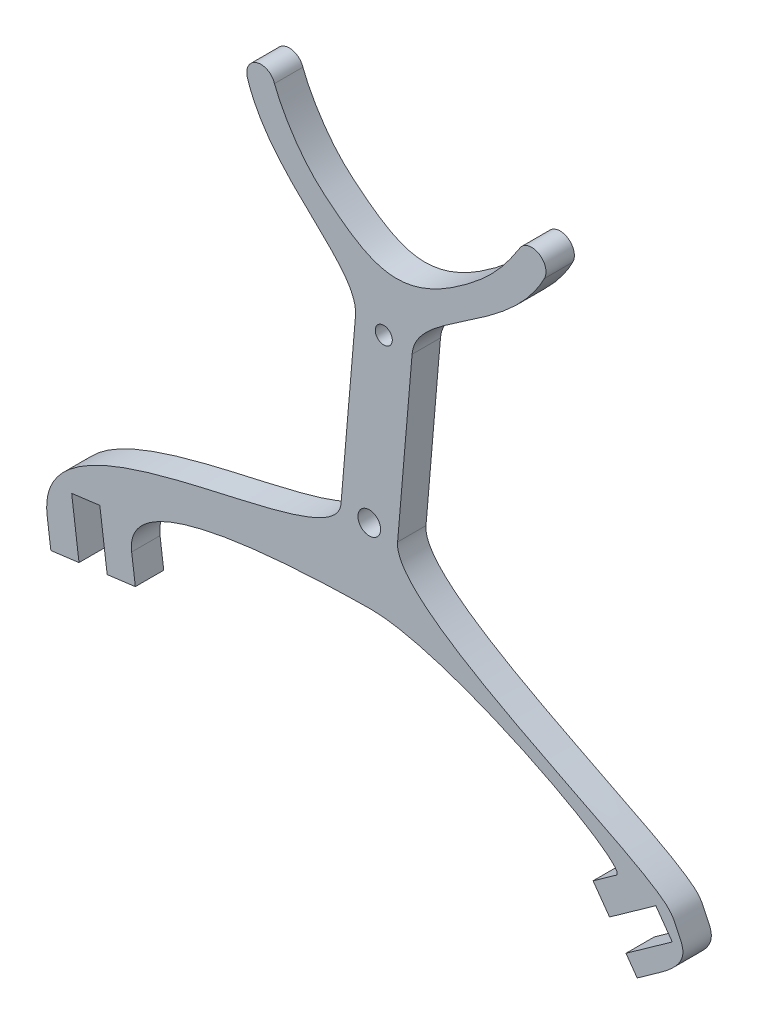
ISO-10303-21;
HEADER;
FILE_DESCRIPTION(('STEP AP214'),'2;1');
FILE_NAME('part.step','',(''),(''),'','','');
FILE_SCHEMA(('AUTOMOTIVE_DESIGN { 1 0 10303 214 1 1 1 1 }'));
ENDSEC;
DATA;
#1=APPLICATION_CONTEXT('core data for automotive mechanical design processes');
#2=APPLICATION_PROTOCOL_DEFINITION('international standard','automotive_design',2000,#1);
#3=PRODUCT_CONTEXT('',#1,'mechanical');
#4=PRODUCT('Part','Part','',(#3));
#5=PRODUCT_RELATED_PRODUCT_CATEGORY('part','',(#4));
#6=PRODUCT_DEFINITION_FORMATION('','',#4);
#7=PRODUCT_DEFINITION_CONTEXT('part definition',#1,'design');
#8=PRODUCT_DEFINITION('design','',#6,#7);
#9=PRODUCT_DEFINITION_SHAPE('','',#8);
#10=(LENGTH_UNIT() NAMED_UNIT(*) SI_UNIT(.MILLI.,.METRE.));
#11=(NAMED_UNIT(*) PLANE_ANGLE_UNIT() SI_UNIT($,.RADIAN.));
#12=(NAMED_UNIT(*) SI_UNIT($,.STERADIAN.) SOLID_ANGLE_UNIT());
#13=UNCERTAINTY_MEASURE_WITH_UNIT(LENGTH_MEASURE(1.E-05),#10,'distance_accuracy_value','');
#14=(GEOMETRIC_REPRESENTATION_CONTEXT(3) GLOBAL_UNCERTAINTY_ASSIGNED_CONTEXT((#13)) GLOBAL_UNIT_ASSIGNED_CONTEXT((#10,
#11,#12)) REPRESENTATION_CONTEXT('',''));
#15=CARTESIAN_POINT('',(0.,0.,0.));
#16=DIRECTION('',(0.,0.,1.));
#17=DIRECTION('',(1.,0.,0.));
#18=AXIS2_PLACEMENT_3D('',#15,#16,#17);
#19=CARTESIAN_POINT('',(-0.855147285631085,2.9330445335862,0.25));
#20=CARTESIAN_POINT('',(-0.802855117328799,2.79152286180849,0.25));
#21=CARTESIAN_POINT('',(-0.626812714664482,2.47827142112427,0.25));
#22=CARTESIAN_POINT('',(-0.0355605612279538,1.99176432732636,0.25));
#23=CARTESIAN_POINT('',(0.301694251700826,1.83750321109511,0.25));
#24=CARTESIAN_POINT('',(1.04416507128505,2.40599952490263,0.25));
#25=CARTESIAN_POINT('',(1.18935322128967,2.58003797829451,0.25));
#26=CARTESIAN_POINT('',(1.29860519890815,2.74932159459001,0.25));
#27=B_SPLINE_CURVE_WITH_KNOTS('',3,(#19,#20,#21,#22,#23,#24,#25,#26),.UNSPECIFIED.,.F.,.F.,(4,1,
1,1,1,4),(0.,0.244258262768071,0.330799972744395,0.806015196761144,0.878875389786914,1.),.UNSPECIFIED.);
#28=DIRECTION('',(0.,0.,-1.));
#29=VECTOR('',#28,1.);
#30=SURFACE_OF_LINEAR_EXTRUSION('',#27,#29);
#31=CARTESIAN_POINT('',(-0.855147285631085,2.9330445335862,0.));
#32=CARTESIAN_POINT('',(-0.802855117328799,2.79152286180849,0.));
#33=CARTESIAN_POINT('',(-0.626812714664482,2.47827142112427,0.));
#34=CARTESIAN_POINT('',(-0.0355605612279538,1.99176432732636,0.));
#35=CARTESIAN_POINT('',(0.301694251700826,1.83750321109511,0.));
#36=CARTESIAN_POINT('',(1.04416507128505,2.40599952490263,0.));
#37=CARTESIAN_POINT('',(1.18935322128967,2.58003797829451,0.));
#38=CARTESIAN_POINT('',(1.29860519890815,2.74932159459001,0.));
#39=B_SPLINE_CURVE_WITH_KNOTS('',3,(#31,#32,#33,#34,#35,#36,#37,#38),.UNSPECIFIED.,.F.,.F.,(4,1,
1,1,1,4),(0.,0.244258262768071,0.330799972744395,0.806015196761144,0.878875389786914,1.),.UNSPECIFIED.);
#40=CARTESIAN_POINT('',(-0.855147285631086,2.9330445335862,0.));
#41=VERTEX_POINT('',#40);
#42=CARTESIAN_POINT('',(1.29860519890815,2.74932159459,0.));
#43=VERTEX_POINT('',#42);
#44=EDGE_CURVE('E478',#41,#43,#39,.T.);
#45=ORIENTED_EDGE('',*,*,#44,.F.);
#46=DIRECTION('',(0.,0.,-1.));
#47=VECTOR('',#46,1.);
#48=CARTESIAN_POINT('',(-0.855147285631086,2.9330445335862,0.25));
#49=LINE('',#48,#47);
#50=CARTESIAN_POINT('',(-0.855147285631086,2.9330445335862,0.25));
#51=VERTEX_POINT('',#50);
#52=EDGE_CURVE('E11',#51,#41,#49,.T.);
#53=ORIENTED_EDGE('',*,*,#52,.F.);
#54=CARTESIAN_POINT('',(1.29860519890815,2.74932159459,0.25));
#55=VERTEX_POINT('',#54);
#56=EDGE_CURVE('E560',#51,#55,#27,.T.);
#57=ORIENTED_EDGE('',*,*,#56,.T.);
#58=DIRECTION('',(0.,0.,-1.));
#59=VECTOR('',#58,1.);
#60=CARTESIAN_POINT('',(1.29860519890815,2.74932159459,0.25));
#61=LINE('',#60,#59);
#62=EDGE_CURVE('E51',#55,#43,#61,.T.);
#63=ORIENTED_EDGE('',*,*,#62,.T.);
#64=EDGE_LOOP('',(#45,#53,#57,#63));
#65=FACE_BOUND('',#64,.T.);
#66=ADVANCED_FACE('F34',(#65),#30,.T.);
#67=CARTESIAN_POINT('',(-0.974284745858485,2.89521246292433,0.25));
#68=DIRECTION('',(0.,0.,-1.));
#69=DIRECTION('',(-1.,0.,0.));
#70=AXIS2_PLACEMENT_3D('',#67,#68,#69);
#71=CYLINDRICAL_SURFACE('',#70,0.125);
#72=CARTESIAN_POINT('',(-0.974284745858485,2.89521246292433,0.));
#73=DIRECTION('',(0.,0.,1.));
#74=DIRECTION('',(1.,0.,0.));
#75=AXIS2_PLACEMENT_3D('',#72,#73,#74);
#76=CIRCLE('',#75,0.125);
#77=CARTESIAN_POINT('',(-1.09342220608589,2.85738039226246,0.));
#78=VERTEX_POINT('',#77);
#79=EDGE_CURVE('E475',#41,#78,#76,.T.);
#80=ORIENTED_EDGE('',*,*,#79,.T.);
#81=DIRECTION('',(0.,0.,-1.));
#82=VECTOR('',#81,1.);
#83=CARTESIAN_POINT('',(-1.09342220608589,2.85738039226246,0.25));
#84=LINE('',#83,#82);
#85=CARTESIAN_POINT('',(-1.09342220608589,2.85738039226246,0.25));
#86=VERTEX_POINT('',#85);
#87=EDGE_CURVE('E43',#86,#78,#84,.T.);
#88=ORIENTED_EDGE('',*,*,#87,.F.);
#89=CARTESIAN_POINT('',(-0.974284745858485,2.89521246292433,0.25));
#90=DIRECTION('',(0.,0.,1.));
#91=DIRECTION('',(1.,0.,0.));
#92=AXIS2_PLACEMENT_3D('',#89,#90,#91);
#93=CIRCLE('',#92,0.125);
#94=EDGE_CURVE('E581',#51,#86,#93,.T.);
#95=ORIENTED_EDGE('',*,*,#94,.F.);
#96=ORIENTED_EDGE('',*,*,#52,.T.);
#97=EDGE_LOOP('',(#80,#88,#95,#96));
#98=FACE_BOUND('',#97,.T.);
#99=ADVANCED_FACE('F476',(#98),#71,.T.);
#100=CARTESIAN_POINT('',(-0.142105820633665,1.51736113385863,0.25));
#101=CARTESIAN_POINT('',(-0.109838871575818,1.89562104022381,0.25));
#102=CARTESIAN_POINT('',(-0.885940974960235,2.20399857919461,0.25));
#103=CARTESIAN_POINT('',(-1.09342220608588,2.85738039226246,0.25));
#104=B_SPLINE_CURVE_WITH_KNOTS('',3,(#100,#101,#102,#103),.UNSPECIFIED.,.F.,.F.,(4,4),(0.,1.),.UNSPECIFIED.);
#105=DIRECTION('',(0.,0.,-1.));
#106=VECTOR('',#105,1.);
#107=SURFACE_OF_LINEAR_EXTRUSION('',#104,#106);
#108=CARTESIAN_POINT('',(-0.142105820633665,1.51736113385863,0.));
#109=CARTESIAN_POINT('',(-0.109838871575818,1.89562104022381,0.));
#110=CARTESIAN_POINT('',(-0.885940974960235,2.20399857919461,0.));
#111=CARTESIAN_POINT('',(-1.09342220608588,2.85738039226246,0.));
#112=B_SPLINE_CURVE_WITH_KNOTS('',3,(#108,#109,#110,#111),.UNSPECIFIED.,.F.,.F.,(4,4),(0.,1.),.UNSPECIFIED.);
#113=CARTESIAN_POINT('',(-0.142105820633664,1.51736113385863,0.));
#114=VERTEX_POINT('',#113);
#115=EDGE_CURVE('E469',#114,#78,#112,.T.);
#116=ORIENTED_EDGE('',*,*,#115,.F.);
#117=DIRECTION('',(0.,0.,-1.));
#118=VECTOR('',#117,1.);
#119=CARTESIAN_POINT('',(-0.142105820633664,1.51736113385863,0.25));
#120=LINE('',#119,#118);
#121=CARTESIAN_POINT('',(-0.142105820633664,1.51736113385863,0.25));
#122=VERTEX_POINT('',#121);
#123=EDGE_CURVE('E461',#122,#114,#120,.T.);
#124=ORIENTED_EDGE('',*,*,#123,.F.);
#125=EDGE_CURVE('E472',#122,#86,#104,.T.);
#126=ORIENTED_EDGE('',*,*,#125,.T.);
#127=ORIENTED_EDGE('',*,*,#87,.T.);
#128=EDGE_LOOP('',(#116,#124,#126,#127));
#129=FACE_BOUND('',#128,.T.);
#130=ADVANCED_FACE('F467',(#129),#107,.T.);
#131=CARTESIAN_POINT('',(-0.761407991854135,-5.74261193882451,0.25));
#132=DIRECTION('',(-0.996381380815078,0.0849949643510695,0.));
#133=DIRECTION('',(-0.0849949643510695,-0.996381380815078,0.));
#134=AXIS2_PLACEMENT_3D('',#131,#132,#133);
#135=PLANE('',#134);
#136=DIRECTION('',(0.0849949643510695,0.996381380815078,0.));
#137=VECTOR('',#136,1.);
#138=CARTESIAN_POINT('',(-0.761407991854135,-5.74261193882451,0.));
#139=LINE('',#138,#137);
#140=CARTESIAN_POINT('',(-0.269598267160269,0.0227890626360175,0.));
#141=VERTEX_POINT('',#140);
#142=EDGE_CURVE('E484',#141,#114,#139,.T.);
#143=ORIENTED_EDGE('',*,*,#142,.F.);
#144=DIRECTION('',(0.,0.,-1.));
#145=VECTOR('',#144,1.);
#146=CARTESIAN_POINT('',(-0.269598267160269,0.0227890626360175,0.25));
#147=LINE('',#146,#145);
#148=CARTESIAN_POINT('',(-0.269598267160269,0.0227890626360175,0.25));
#149=VERTEX_POINT('',#148);
#150=EDGE_CURVE('E459',#149,#141,#147,.T.);
#151=ORIENTED_EDGE('',*,*,#150,.F.);
#152=DIRECTION('',(0.0849949643510695,0.996381380815078,0.));
#153=VECTOR('',#152,1.);
#154=CARTESIAN_POINT('',(-0.761407991854135,-5.74261193882451,0.25));
#155=LINE('',#154,#153);
#156=EDGE_CURVE('E342',#149,#122,#155,.T.);
#157=ORIENTED_EDGE('',*,*,#156,.T.);
#158=ORIENTED_EDGE('',*,*,#123,.T.);
#159=EDGE_LOOP('',(#143,#151,#157,#158));
#160=FACE_BOUND('',#159,.T.);
#161=ADVANCED_FACE('F332',(#160),#135,.T.);
#162=CARTESIAN_POINT('',(-0.269598267160269,0.0227890626360177,0.25));
#163=CARTESIAN_POINT('',(-0.313593622573834,-0.492960938685871,0.25));
#164=CARTESIAN_POINT('',(-2.98303705518907,-0.387631245694397,0.25));
#165=CARTESIAN_POINT('',(-2.85603192304726,-1.36345511436312,0.25));
#166=B_SPLINE_CURVE_WITH_KNOTS('',3,(#162,#163,#164,#165),.UNSPECIFIED.,.F.,.F.,(4,4),(0.,1.),.UNSPECIFIED.);
#167=DIRECTION('',(0.,0.,-1.));
#168=VECTOR('',#167,1.);
#169=SURFACE_OF_LINEAR_EXTRUSION('',#166,#168);
#170=CARTESIAN_POINT('',(-0.269598267160269,0.0227890626360177,0.));
#171=CARTESIAN_POINT('',(-0.313593622573834,-0.492960938685871,0.));
#172=CARTESIAN_POINT('',(-2.98303705518907,-0.387631245694397,0.));
#173=CARTESIAN_POINT('',(-2.85603192304726,-1.36345511436312,0.));
#174=B_SPLINE_CURVE_WITH_KNOTS('',3,(#170,#171,#172,#173),.UNSPECIFIED.,.F.,.F.,(4,4),(0.,1.),.UNSPECIFIED.);
#175=CARTESIAN_POINT('',(-2.85603192304726,-1.36345511436312,0.));
#176=VERTEX_POINT('',#175);
#177=EDGE_CURVE('E486',#141,#176,#174,.T.);
#178=ORIENTED_EDGE('',*,*,#177,.T.);
#179=DIRECTION('',(0.,0.,-1.));
#180=VECTOR('',#179,1.);
#181=CARTESIAN_POINT('',(-2.85603192304726,-1.36345511436312,0.25));
#182=LINE('',#181,#180);
#183=CARTESIAN_POINT('',(-2.85603192304726,-1.36345511436312,0.25));
#184=VERTEX_POINT('',#183);
#185=EDGE_CURVE('E457',#184,#176,#182,.T.);
#186=ORIENTED_EDGE('',*,*,#185,.F.);
#187=EDGE_CURVE('E335',#149,#184,#166,.T.);
#188=ORIENTED_EDGE('',*,*,#187,.F.);
#189=ORIENTED_EDGE('',*,*,#150,.T.);
#190=EDGE_LOOP('',(#178,#186,#188,#189));
#191=FACE_BOUND('',#190,.T.);
#192=ADVANCED_FACE('F327',(#191),#169,.F.);
#193=CARTESIAN_POINT('',(-2.24436686854065,-6.06308693043548,0.25));
#194=DIRECTION('',(-0.991636375678007,-0.129063156757403,0.));
#195=DIRECTION('',(0.129063156757403,-0.991636375678007,0.));
#196=AXIS2_PLACEMENT_3D('',#193,#194,#195);
#197=PLANE('',#196);
#198=DIRECTION('',(-0.129063156757403,0.991636375678007,0.));
#199=VECTOR('',#198,1.);
#200=CARTESIAN_POINT('',(-2.24436686854065,-6.06308693043548,0.));
#201=LINE('',#200,#199);
#202=CARTESIAN_POINT('',(-2.82376613385791,-1.61136420828262,0.));
#203=VERTEX_POINT('',#202);
#204=EDGE_CURVE('E499',#203,#176,#201,.T.);
#205=ORIENTED_EDGE('',*,*,#204,.F.);
#206=DIRECTION('',(0.,0.,-1.));
#207=VECTOR('',#206,1.);
#208=CARTESIAN_POINT('',(-2.82376613385791,-1.61136420828262,0.25));
#209=LINE('',#208,#207);
#210=CARTESIAN_POINT('',(-2.82376613385791,-1.61136420828262,0.25));
#211=VERTEX_POINT('',#210);
#212=EDGE_CURVE('E455',#211,#203,#209,.T.);
#213=ORIENTED_EDGE('',*,*,#212,.F.);
#214=DIRECTION('',(-0.129063156757403,0.991636375678007,0.));
#215=VECTOR('',#214,1.);
#216=CARTESIAN_POINT('',(-2.24436686854065,-6.06308693043548,0.25));
#217=LINE('',#216,#215);
#218=EDGE_CURVE('E341',#211,#184,#217,.T.);
#219=ORIENTED_EDGE('',*,*,#218,.T.);
#220=ORIENTED_EDGE('',*,*,#185,.T.);
#221=EDGE_LOOP('',(#205,#213,#219,#220));
#222=FACE_BOUND('',#221,.T.);
#223=ADVANCED_FACE('F323',(#222),#197,.T.);
#224=CARTESIAN_POINT('',(-0.749197987631896,-1.34135564422887,0.25));
#225=DIRECTION('',(0.129063156757403,-0.991636375678007,0.));
#226=DIRECTION('',(0.991636375678007,0.129063156757403,0.));
#227=AXIS2_PLACEMENT_3D('',#224,#225,#226);
#228=PLANE('',#227);
#229=DIRECTION('',(-0.991636375678007,-0.129063156757403,0.));
#230=VECTOR('',#229,1.);
#231=CARTESIAN_POINT('',(-0.749197987631896,-1.34135564422887,0.));
#232=LINE('',#231,#230);
#233=CARTESIAN_POINT('',(-2.57585703993841,-1.57909841909327,0.));
#234=VERTEX_POINT('',#233);
#235=EDGE_CURVE('E505',#234,#203,#232,.T.);
#236=ORIENTED_EDGE('',*,*,#235,.F.);
#237=DIRECTION('',(0.,0.,-1.));
#238=VECTOR('',#237,1.);
#239=CARTESIAN_POINT('',(-2.57585703993841,-1.57909841909327,0.25));
#240=LINE('',#239,#238);
#241=CARTESIAN_POINT('',(-2.57585703993841,-1.57909841909327,0.25));
#242=VERTEX_POINT('',#241);
#243=EDGE_CURVE('E453',#242,#234,#240,.T.);
#244=ORIENTED_EDGE('',*,*,#243,.F.);
#245=DIRECTION('',(-0.991636375678007,-0.129063156757403,0.));
#246=VECTOR('',#245,1.);
#247=CARTESIAN_POINT('',(-0.749197987631896,-1.34135564422887,0.25));
#248=LINE('',#247,#246);
#249=EDGE_CURVE('E349',#242,#211,#248,.T.);
#250=ORIENTED_EDGE('',*,*,#249,.T.);
#251=ORIENTED_EDGE('',*,*,#212,.T.);
#252=EDGE_LOOP('',(#236,#244,#250,#251));
#253=FACE_BOUND('',#252,.T.);
#254=ADVANCED_FACE('F319',(#253),#228,.T.);
#255=CARTESIAN_POINT('',(-1.99645777462115,-6.03082114124613,0.25));
#256=DIRECTION('',(-0.991636375678007,-0.129063156757403,0.));
#257=DIRECTION('',(0.129063156757403,-0.991636375678007,0.));
#258=AXIS2_PLACEMENT_3D('',#255,#256,#257);
#259=PLANE('',#258);
#260=DIRECTION('',(-0.129063156757403,0.991636375678007,0.));
#261=VECTOR('',#260,1.);
#262=CARTESIAN_POINT('',(-1.99645777462115,-6.03082114124613,0.));
#263=LINE('',#262,#261);
#264=CARTESIAN_POINT('',(-2.64038861831711,-1.08328023125426,0.));
#265=VERTEX_POINT('',#264);
#266=EDGE_CURVE('E508',#234,#265,#263,.T.);
#267=ORIENTED_EDGE('',*,*,#266,.T.);
#268=DIRECTION('',(0.,0.,-1.));
#269=VECTOR('',#268,1.);
#270=CARTESIAN_POINT('',(-2.64038861831711,-1.08328023125426,0.25));
#271=LINE('',#270,#269);
#272=CARTESIAN_POINT('',(-2.64038861831711,-1.08328023125426,0.25));
#273=VERTEX_POINT('',#272);
#274=EDGE_CURVE('E450',#273,#265,#271,.T.);
#275=ORIENTED_EDGE('',*,*,#274,.F.);
#276=DIRECTION('',(-0.129063156757403,0.991636375678007,0.));
#277=VECTOR('',#276,1.);
#278=CARTESIAN_POINT('',(-1.99645777462115,-6.03082114124613,0.25));
#279=LINE('',#278,#277);
#280=EDGE_CURVE('E352',#242,#273,#279,.T.);
#281=ORIENTED_EDGE('',*,*,#280,.F.);
#282=ORIENTED_EDGE('',*,*,#243,.T.);
#283=EDGE_LOOP('',(#267,#275,#281,#282));
#284=FACE_BOUND('',#283,.T.);
#285=ADVANCED_FACE('F315',(#284),#259,.F.);
#286=CARTESIAN_POINT('',(-0.813729566010598,-0.845537456389866,0.25));
#287=DIRECTION('',(-0.129063156757403,0.991636375678007,0.));
#288=DIRECTION('',(-0.991636375678007,-0.129063156757403,0.));
#289=AXIS2_PLACEMENT_3D('',#286,#287,#288);
#290=PLANE('',#289);
#291=DIRECTION('',(0.991636375678007,0.129063156757403,0.));
#292=VECTOR('',#291,1.);
#293=CARTESIAN_POINT('',(-0.813729566010598,-0.845537456389866,0.));
#294=LINE('',#293,#292);
#295=CARTESIAN_POINT('',(-2.39247952439761,-1.05101444206491,0.));
#296=VERTEX_POINT('',#295);
#297=EDGE_CURVE('E510',#265,#296,#294,.T.);
#298=ORIENTED_EDGE('',*,*,#297,.T.);
#299=DIRECTION('',(0.,0.,-1.));
#300=VECTOR('',#299,1.);
#301=CARTESIAN_POINT('',(-2.39247952439761,-1.05101444206491,0.25));
#302=LINE('',#301,#300);
#303=CARTESIAN_POINT('',(-2.39247952439761,-1.05101444206491,0.25));
#304=VERTEX_POINT('',#303);
#305=EDGE_CURVE('E447',#304,#296,#302,.T.);
#306=ORIENTED_EDGE('',*,*,#305,.F.);
#307=DIRECTION('',(0.991636375678007,0.129063156757403,0.));
#308=VECTOR('',#307,1.);
#309=CARTESIAN_POINT('',(-0.813729566010598,-0.845537456389866,0.25));
#310=LINE('',#309,#308);
#311=EDGE_CURVE('E354',#273,#304,#310,.T.);
#312=ORIENTED_EDGE('',*,*,#311,.F.);
#313=ORIENTED_EDGE('',*,*,#274,.T.);
#314=EDGE_LOOP('',(#298,#306,#312,#313));
#315=FACE_BOUND('',#314,.T.);
#316=ADVANCED_FACE('F311',(#315),#290,.F.);
#317=CARTESIAN_POINT('',(-1.74854868070165,-5.99855535205678,0.25));
#318=DIRECTION('',(0.991636375678007,0.129063156757403,0.));
#319=DIRECTION('',(-0.129063156757403,0.991636375678007,0.));
#320=AXIS2_PLACEMENT_3D('',#317,#318,#319);
#321=PLANE('',#320);
#322=DIRECTION('',(0.129063156757403,-0.991636375678007,0.));
#323=VECTOR('',#322,1.);
#324=CARTESIAN_POINT('',(-1.74854868070165,-5.99855535205678,0.));
#325=LINE('',#324,#323);
#326=CARTESIAN_POINT('',(-2.32794794601891,-1.54683262990392,0.));
#327=VERTEX_POINT('',#326);
#328=EDGE_CURVE('E512',#296,#327,#325,.T.);
#329=ORIENTED_EDGE('',*,*,#328,.T.);
#330=DIRECTION('',(0.,0.,-1.));
#331=VECTOR('',#330,1.);
#332=CARTESIAN_POINT('',(-2.32794794601891,-1.54683262990392,0.25));
#333=LINE('',#332,#331);
#334=CARTESIAN_POINT('',(-2.32794794601891,-1.54683262990392,0.25));
#335=VERTEX_POINT('',#334);
#336=EDGE_CURVE('E444',#335,#327,#333,.T.);
#337=ORIENTED_EDGE('',*,*,#336,.F.);
#338=DIRECTION('',(0.129063156757403,-0.991636375678007,0.));
#339=VECTOR('',#338,1.);
#340=CARTESIAN_POINT('',(-1.74854868070165,-5.99855535205678,0.25));
#341=LINE('',#340,#339);
#342=EDGE_CURVE('E356',#304,#335,#341,.T.);
#343=ORIENTED_EDGE('',*,*,#342,.F.);
#344=ORIENTED_EDGE('',*,*,#305,.T.);
#345=EDGE_LOOP('',(#329,#337,#343,#344));
#346=FACE_BOUND('',#345,.T.);
#347=ADVANCED_FACE('F307',(#346),#321,.F.);
#348=CARTESIAN_POINT('',(-0.749197987631896,-1.34135564422887,0.25));
#349=DIRECTION('',(-0.129063156757403,0.991636375678007,0.));
#350=DIRECTION('',(-0.991636375678007,-0.129063156757403,0.));
#351=AXIS2_PLACEMENT_3D('',#348,#349,#350);
#352=PLANE('',#351);
#353=DIRECTION('',(0.991636375678007,0.129063156757403,0.));
#354=VECTOR('',#353,1.);
#355=CARTESIAN_POINT('',(-0.749197987631896,-1.34135564422887,0.));
#356=LINE('',#355,#354);
#357=CARTESIAN_POINT('',(-2.08003885209941,-1.51456684071457,0.));
#358=VERTEX_POINT('',#357);
#359=EDGE_CURVE('E514',#327,#358,#356,.T.);
#360=ORIENTED_EDGE('',*,*,#359,.T.);
#361=DIRECTION('',(0.,0.,-1.));
#362=VECTOR('',#361,1.);
#363=CARTESIAN_POINT('',(-2.08003885209941,-1.51456684071457,0.25));
#364=LINE('',#363,#362);
#365=CARTESIAN_POINT('',(-2.08003885209941,-1.51456684071457,0.25));
#366=VERTEX_POINT('',#365);
#367=EDGE_CURVE('E441',#366,#358,#364,.T.);
#368=ORIENTED_EDGE('',*,*,#367,.F.);
#369=DIRECTION('',(0.991636375678007,0.129063156757403,0.));
#370=VECTOR('',#369,1.);
#371=CARTESIAN_POINT('',(-0.749197987631896,-1.34135564422887,0.25));
#372=LINE('',#371,#370);
#373=EDGE_CURVE('E358',#335,#366,#372,.T.);
#374=ORIENTED_EDGE('',*,*,#373,.F.);
#375=ORIENTED_EDGE('',*,*,#336,.T.);
#376=EDGE_LOOP('',(#360,#368,#374,#375));
#377=FACE_BOUND('',#376,.T.);
#378=ADVANCED_FACE('F303',(#377),#352,.F.);
#379=CARTESIAN_POINT('',(-1.50063958678214,-5.96628956286743,0.25));
#380=DIRECTION('',(-0.991636375678007,-0.129063156757404,0.));
#381=DIRECTION('',(0.129063156757404,-0.991636375678007,0.));
#382=AXIS2_PLACEMENT_3D('',#379,#380,#381);
#383=PLANE('',#382);
#384=DIRECTION('',(-0.129063156757404,0.991636375678007,0.));
#385=VECTOR('',#384,1.);
#386=CARTESIAN_POINT('',(-1.50063958678214,-5.96628956286743,0.));
#387=LINE('',#386,#385);
#388=CARTESIAN_POINT('',(-2.11230464128876,-1.26665774679506,0.));
#389=VERTEX_POINT('',#388);
#390=EDGE_CURVE('E516',#358,#389,#387,.T.);
#391=ORIENTED_EDGE('',*,*,#390,.T.);
#392=DIRECTION('',(0.,0.,-1.));
#393=VECTOR('',#392,1.);
#394=CARTESIAN_POINT('',(-2.11230464128876,-1.26665774679506,0.25));
#395=LINE('',#394,#393);
#396=CARTESIAN_POINT('',(-2.11230464128876,-1.26665774679506,0.25));
#397=VERTEX_POINT('',#396);
#398=EDGE_CURVE('E374',#397,#389,#395,.T.);
#399=ORIENTED_EDGE('',*,*,#398,.F.);
#400=DIRECTION('',(-0.129063156757404,0.991636375678007,0.));
#401=VECTOR('',#400,1.);
#402=CARTESIAN_POINT('',(-1.50063958678214,-5.96628956286743,0.25));
#403=LINE('',#402,#401);
#404=EDGE_CURVE('E359',#366,#397,#403,.T.);
#405=ORIENTED_EDGE('',*,*,#404,.F.);
#406=ORIENTED_EDGE('',*,*,#367,.T.);
#407=EDGE_LOOP('',(#391,#399,#405,#406));
#408=FACE_BOUND('',#407,.T.);
#409=ADVANCED_FACE('F299',(#408),#383,.F.);
#410=CARTESIAN_POINT('',(-2.11230464128876,-1.26665774679506,0.25));
#411=CARTESIAN_POINT('',(-2.1889360253908,-0.677872613195919,0.25));
#412=CARTESIAN_POINT('',(0.,-0.64929220030405,0.25));
#413=B_SPLINE_CURVE_WITH_KNOTS('',2,(#410,#411,#412),.UNSPECIFIED.,.F.,.F.,(3,3),(0.,1.),.UNSPECIFIED.);
#414=DIRECTION('',(0.,0.,-1.));
#415=VECTOR('',#414,1.);
#416=SURFACE_OF_LINEAR_EXTRUSION('',#413,#415);
#417=CARTESIAN_POINT('',(-2.11230464128876,-1.26665774679506,0.));
#418=CARTESIAN_POINT('',(-2.1889360253908,-0.677872613195919,0.));
#419=CARTESIAN_POINT('',(0.,-0.64929220030405,0.));
#420=B_SPLINE_CURVE_WITH_KNOTS('',2,(#417,#418,#419),.UNSPECIFIED.,.F.,.F.,(3,3),(0.,1.),.UNSPECIFIED.);
#421=CARTESIAN_POINT('',(0.,-0.64929220030405,0.));
#422=VERTEX_POINT('',#421);
#423=EDGE_CURVE('E371',#389,#422,#420,.T.);
#424=ORIENTED_EDGE('',*,*,#423,.T.);
#425=DIRECTION('',(0.,0.,-1.));
#426=VECTOR('',#425,1.);
#427=CARTESIAN_POINT('',(0.,-0.64929220030405,0.25));
#428=LINE('',#427,#426);
#429=CARTESIAN_POINT('',(0.,-0.64929220030405,0.25));
#430=VERTEX_POINT('',#429);
#431=EDGE_CURVE('E369',#430,#422,#428,.T.);
#432=ORIENTED_EDGE('',*,*,#431,.F.);
#433=EDGE_CURVE('E280',#397,#430,#413,.T.);
#434=ORIENTED_EDGE('',*,*,#433,.F.);
#435=ORIENTED_EDGE('',*,*,#398,.T.);
#436=EDGE_LOOP('',(#424,#432,#434,#435));
#437=FACE_BOUND('',#436,.T.);
#438=ADVANCED_FACE('F294',(#437),#416,.F.);
#439=CARTESIAN_POINT('',(0.,-0.64929220030405,0.25));
#440=CARTESIAN_POINT('',(0.733736910810836,-0.658123461773865,0.25));
#441=CARTESIAN_POINT('',(2.29312135992851,-1.49770982752489,0.25));
#442=CARTESIAN_POINT('',(2.1528932377239,-1.59742172139941,0.25));
#443=B_SPLINE_CURVE_WITH_KNOTS('',3,(#439,#440,#441,#442),.UNSPECIFIED.,.F.,.F.,(4,4),(0.,1.),.UNSPECIFIED.);
#444=DIRECTION('',(0.,0.,-1.));
#445=VECTOR('',#444,1.);
#446=SURFACE_OF_LINEAR_EXTRUSION('',#443,#445);
#447=CARTESIAN_POINT('',(0.,-0.64929220030405,0.));
#448=CARTESIAN_POINT('',(0.733736910810836,-0.658123461773865,0.));
#449=CARTESIAN_POINT('',(2.29312135992851,-1.49770982752489,0.));
#450=CARTESIAN_POINT('',(2.1528932377239,-1.59742172139941,0.));
#451=B_SPLINE_CURVE_WITH_KNOTS('',3,(#447,#448,#449,#450),.UNSPECIFIED.,.F.,.F.,(4,4),(0.,1.),.UNSPECIFIED.);
#452=CARTESIAN_POINT('',(2.1528932377239,-1.59742172139941,0.));
#453=VERTEX_POINT('',#452);
#454=EDGE_CURVE('E377',#422,#453,#451,.T.);
#455=ORIENTED_EDGE('',*,*,#454,.T.);
#456=DIRECTION('',(0.,0.,-1.));
#457=VECTOR('',#456,1.);
#458=CARTESIAN_POINT('',(2.1528932377239,-1.59742172139941,0.25));
#459=LINE('',#458,#457);
#460=CARTESIAN_POINT('',(2.1528932377239,-1.59742172139941,0.25));
#461=VERTEX_POINT('',#460);
#462=EDGE_CURVE('E375',#461,#453,#459,.T.);
#463=ORIENTED_EDGE('',*,*,#462,.F.);
#464=EDGE_CURVE('E275',#430,#461,#443,.T.);
#465=ORIENTED_EDGE('',*,*,#464,.F.);
#466=ORIENTED_EDGE('',*,*,#431,.T.);
#467=EDGE_LOOP('',(#455,#463,#465,#466));
#468=FACE_BOUND('',#467,.T.);
#469=ADVANCED_FACE('F289',(#468),#446,.F.);
#470=CARTESIAN_POINT('',(-1.37130031123048,-4.10336708829137,0.25));
#471=DIRECTION('',(-0.579501082590597,0.814971468995281,0.));
#472=DIRECTION('',(-0.814971468995281,-0.579501082590597,0.));
#473=AXIS2_PLACEMENT_3D('',#470,#471,#472);
#474=PLANE('',#473);
#475=DIRECTION('',(0.814971468995281,0.579501082590597,0.));
#476=VECTOR('',#475,1.);
#477=CARTESIAN_POINT('',(-1.37130031123048,-4.10336708829137,0.));
#478=LINE('',#477,#476);
#479=CARTESIAN_POINT('',(1.94915037047508,-1.74229699204706,0.));
#480=VERTEX_POINT('',#479);
#481=EDGE_CURVE('E527',#480,#453,#478,.T.);
#482=ORIENTED_EDGE('',*,*,#481,.F.);
#483=DIRECTION('',(0.,0.,-1.));
#484=VECTOR('',#483,1.);
#485=CARTESIAN_POINT('',(1.94915037047508,-1.74229699204706,0.25));
#486=LINE('',#485,#484);
#487=CARTESIAN_POINT('',(1.94915037047508,-1.74229699204706,0.25));
#488=VERTEX_POINT('',#487);
#489=EDGE_CURVE('E381',#488,#480,#486,.T.);
#490=ORIENTED_EDGE('',*,*,#489,.F.);
#491=DIRECTION('',(0.814971468995281,0.579501082590597,0.));
#492=VECTOR('',#491,1.);
#493=CARTESIAN_POINT('',(-1.37130031123048,-4.10336708829137,0.25));
#494=LINE('',#493,#492);
#495=EDGE_CURVE('E272',#488,#461,#494,.T.);
#496=ORIENTED_EDGE('',*,*,#495,.T.);
#497=ORIENTED_EDGE('',*,*,#462,.T.);
#498=EDGE_LOOP('',(#482,#490,#496,#497));
#499=FACE_BOUND('',#498,.T.);
#500=ADVANCED_FACE('F293',(#499),#474,.T.);
#501=CARTESIAN_POINT('',(3.15065195939092,-3.43200827013742,0.25));
#502=DIRECTION('',(-0.81497146899528,-0.579501082590598,0.));
#503=DIRECTION('',(0.579501082590598,-0.81497146899528,0.));
#504=AXIS2_PLACEMENT_3D('',#501,#502,#503);
#505=PLANE('',#504);
#506=DIRECTION('',(-0.579501082590598,0.81497146899528,0.));
#507=VECTOR('',#506,1.);
#508=CARTESIAN_POINT('',(3.15065195939092,-3.43200827013742,0.));
#509=LINE('',#508,#507);
#510=CARTESIAN_POINT('',(2.09402564112273,-1.94603985929588,0.));
#511=VERTEX_POINT('',#510);
#512=EDGE_CURVE('E390',#511,#480,#509,.T.);
#513=ORIENTED_EDGE('',*,*,#512,.F.);
#514=DIRECTION('',(0.,0.,-1.));
#515=VECTOR('',#514,1.);
#516=CARTESIAN_POINT('',(2.09402564112273,-1.94603985929588,0.25));
#517=LINE('',#516,#515);
#518=CARTESIAN_POINT('',(2.09402564112273,-1.94603985929588,0.25));
#519=VERTEX_POINT('',#518);
#520=EDGE_CURVE('E387',#519,#511,#517,.T.);
#521=ORIENTED_EDGE('',*,*,#520,.F.);
#522=DIRECTION('',(-0.579501082590598,0.81497146899528,0.));
#523=VECTOR('',#522,1.);
#524=CARTESIAN_POINT('',(3.15065195939092,-3.43200827013742,0.25));
#525=LINE('',#524,#523);
#526=EDGE_CURVE('E269',#519,#488,#525,.T.);
#527=ORIENTED_EDGE('',*,*,#526,.T.);
#528=ORIENTED_EDGE('',*,*,#489,.T.);
#529=EDGE_LOOP('',(#513,#521,#527,#528));
#530=FACE_BOUND('',#529,.T.);
#531=ADVANCED_FACE('F386',(#530),#505,.T.);
#532=CARTESIAN_POINT('',(-1.22642504058283,-4.30710995554019,0.25));
#533=DIRECTION('',(-0.579501082590597,0.814971468995281,0.));
#534=DIRECTION('',(-0.814971468995281,-0.579501082590597,0.));
#535=AXIS2_PLACEMENT_3D('',#532,#533,#534);
#536=PLANE('',#535);
#537=DIRECTION('',(0.814971468995281,0.579501082590597,0.));
#538=VECTOR('',#537,1.);
#539=CARTESIAN_POINT('',(-1.22642504058283,-4.30710995554019,0.));
#540=LINE('',#539,#538);
#541=CARTESIAN_POINT('',(2.50151137562037,-1.65628931800058,0.));
#542=VERTEX_POINT('',#541);
#543=EDGE_CURVE('E533',#511,#542,#540,.T.);
#544=ORIENTED_EDGE('',*,*,#543,.T.);
#545=DIRECTION('',(0.,0.,-1.));
#546=VECTOR('',#545,1.);
#547=CARTESIAN_POINT('',(2.50151137562037,-1.65628931800058,0.25));
#548=LINE('',#547,#546);
#549=CARTESIAN_POINT('',(2.50151137562037,-1.65628931800058,0.25));
#550=VERTEX_POINT('',#549);
#551=EDGE_CURVE('E393',#550,#542,#548,.T.);
#552=ORIENTED_EDGE('',*,*,#551,.F.);
#553=DIRECTION('',(0.814971468995281,0.579501082590597,0.));
#554=VECTOR('',#553,1.);
#555=CARTESIAN_POINT('',(-1.22642504058283,-4.30710995554019,0.25));
#556=LINE('',#555,#554);
#557=EDGE_CURVE('E267',#519,#550,#556,.T.);
#558=ORIENTED_EDGE('',*,*,#557,.F.);
#559=ORIENTED_EDGE('',*,*,#520,.T.);
#560=EDGE_LOOP('',(#544,#552,#558,#559));
#561=FACE_BOUND('',#560,.T.);
#562=ADVANCED_FACE('F396',(#561),#536,.F.);
#563=CARTESIAN_POINT('',(3.55813769388856,-3.14225772884213,0.25));
#564=DIRECTION('',(0.814971468995282,0.579501082590596,0.));
#565=DIRECTION('',(-0.579501082590596,0.814971468995282,0.));
#566=AXIS2_PLACEMENT_3D('',#563,#564,#565);
#567=PLANE('',#566);
#568=DIRECTION('',(0.579501082590596,-0.814971468995282,0.));
#569=VECTOR('',#568,1.);
#570=CARTESIAN_POINT('',(3.55813769388856,-3.14225772884213,0.));
#571=LINE('',#570,#569);
#572=CARTESIAN_POINT('',(2.64638664626802,-1.8600321852494,0.));
#573=VERTEX_POINT('',#572);
#574=EDGE_CURVE('E407',#542,#573,#571,.T.);
#575=ORIENTED_EDGE('',*,*,#574,.T.);
#576=DIRECTION('',(0.,0.,-1.));
#577=VECTOR('',#576,1.);
#578=CARTESIAN_POINT('',(2.64638664626802,-1.8600321852494,0.25));
#579=LINE('',#578,#577);
#580=CARTESIAN_POINT('',(2.64638664626802,-1.8600321852494,0.25));
#581=VERTEX_POINT('',#580);
#582=EDGE_CURVE('E404',#581,#573,#579,.T.);
#583=ORIENTED_EDGE('',*,*,#582,.F.);
#584=DIRECTION('',(0.579501082590596,-0.814971468995282,0.));
#585=VECTOR('',#584,1.);
#586=CARTESIAN_POINT('',(3.55813769388856,-3.14225772884213,0.25));
#587=LINE('',#586,#585);
#588=EDGE_CURVE('E265',#550,#581,#587,.T.);
#589=ORIENTED_EDGE('',*,*,#588,.F.);
#590=ORIENTED_EDGE('',*,*,#551,.T.);
#591=EDGE_LOOP('',(#575,#583,#589,#590));
#592=FACE_BOUND('',#591,.T.);
#593=ADVANCED_FACE('F405',(#592),#567,.F.);
#594=CARTESIAN_POINT('',(-1.08154976993518,-4.51085282278901,0.25));
#595=DIRECTION('',(0.579501082590597,-0.814971468995281,0.));
#596=DIRECTION('',(0.814971468995281,0.579501082590597,0.));
#597=AXIS2_PLACEMENT_3D('',#594,#595,#596);
#598=PLANE('',#597);
#599=DIRECTION('',(-0.814971468995281,-0.579501082590597,0.));
#600=VECTOR('',#599,1.);
#601=CARTESIAN_POINT('',(-1.08154976993518,-4.51085282278901,0.));
#602=LINE('',#601,#600);
#603=CARTESIAN_POINT('',(2.23890091177038,-2.1497827265447,0.));
#604=VERTEX_POINT('',#603);
#605=EDGE_CURVE('E415',#573,#604,#602,.T.);
#606=ORIENTED_EDGE('',*,*,#605,.T.);
#607=DIRECTION('',(0.,0.,-1.));
#608=VECTOR('',#607,1.);
#609=CARTESIAN_POINT('',(2.23890091177038,-2.1497827265447,0.25));
#610=LINE('',#609,#608);
#611=CARTESIAN_POINT('',(2.23890091177038,-2.1497827265447,0.25));
#612=VERTEX_POINT('',#611);
#613=EDGE_CURVE('E410',#612,#604,#610,.T.);
#614=ORIENTED_EDGE('',*,*,#613,.F.);
#615=DIRECTION('',(-0.814971468995281,-0.579501082590597,0.));
#616=VECTOR('',#615,1.);
#617=CARTESIAN_POINT('',(-1.08154976993518,-4.51085282278901,0.25));
#618=LINE('',#617,#616);
#619=EDGE_CURVE('E263',#581,#612,#618,.T.);
#620=ORIENTED_EDGE('',*,*,#619,.F.);
#621=ORIENTED_EDGE('',*,*,#582,.T.);
#622=EDGE_LOOP('',(#606,#614,#620,#621));
#623=FACE_BOUND('',#622,.T.);
#624=ADVANCED_FACE('F412',(#623),#598,.F.);
#625=CARTESIAN_POINT('',(3.15065195939092,-3.43200827013742,0.25));
#626=DIRECTION('',(0.814971468995281,0.579501082590597,0.));
#627=DIRECTION('',(-0.579501082590597,0.814971468995281,0.));
#628=AXIS2_PLACEMENT_3D('',#625,#626,#627);
#629=PLANE('',#628);
#630=DIRECTION('',(0.579501082590597,-0.814971468995281,0.));
#631=VECTOR('',#630,1.);
#632=CARTESIAN_POINT('',(3.15065195939092,-3.43200827013742,0.));
#633=LINE('',#632,#631);
#634=CARTESIAN_POINT('',(2.33789433997986,-2.28900044680866,0.));
#635=VERTEX_POINT('',#634);
#636=EDGE_CURVE('E537',#604,#635,#633,.T.);
#637=ORIENTED_EDGE('',*,*,#636,.T.);
#638=DIRECTION('',(0.,0.,-1.));
#639=VECTOR('',#638,1.);
#640=CARTESIAN_POINT('',(2.33789433997986,-2.28900044680866,0.25));
#641=LINE('',#640,#639);
#642=CARTESIAN_POINT('',(2.33789433997986,-2.28900044680866,0.25));
#643=VERTEX_POINT('',#642);
#644=EDGE_CURVE('E418',#643,#635,#641,.T.);
#645=ORIENTED_EDGE('',*,*,#644,.F.);
#646=DIRECTION('',(0.579501082590597,-0.814971468995281,0.));
#647=VECTOR('',#646,1.);
#648=CARTESIAN_POINT('',(3.15065195939092,-3.43200827013742,0.25));
#649=LINE('',#648,#647);
#650=EDGE_CURVE('E261',#612,#643,#649,.T.);
#651=ORIENTED_EDGE('',*,*,#650,.F.);
#652=ORIENTED_EDGE('',*,*,#613,.T.);
#653=EDGE_LOOP('',(#637,#645,#651,#652));
#654=FACE_BOUND('',#653,.T.);
#655=ADVANCED_FACE('F421',(#654),#629,.F.);
#656=CARTESIAN_POINT('',(-0.982556341725695,-4.65007054305298,0.25));
#657=DIRECTION('',(-0.579501082590597,0.814971468995281,0.));
#658=DIRECTION('',(-0.814971468995281,-0.579501082590597,0.));
#659=AXIS2_PLACEMENT_3D('',#656,#657,#658);
#660=PLANE('',#659);
#661=DIRECTION('',(0.814971468995281,0.579501082590597,0.));
#662=VECTOR('',#661,1.);
#663=CARTESIAN_POINT('',(-0.982556341725695,-4.65007054305298,0.));
#664=LINE('',#663,#662);
#665=CARTESIAN_POINT('',(2.54163720722868,-2.14412517616102,0.));
#666=VERTEX_POINT('',#665);
#667=EDGE_CURVE('E429',#635,#666,#664,.T.);
#668=ORIENTED_EDGE('',*,*,#667,.T.);
#669=DIRECTION('',(0.,0.,-1.));
#670=VECTOR('',#669,1.);
#671=CARTESIAN_POINT('',(2.54163720722868,-2.14412517616102,0.25));
#672=LINE('',#671,#670);
#673=CARTESIAN_POINT('',(2.54163720722868,-2.14412517616102,0.25));
#674=VERTEX_POINT('',#673);
#675=EDGE_CURVE('E427',#674,#666,#672,.T.);
#676=ORIENTED_EDGE('',*,*,#675,.F.);
#677=DIRECTION('',(0.814971468995281,0.579501082590597,0.));
#678=VECTOR('',#677,1.);
#679=CARTESIAN_POINT('',(-0.982556341725695,-4.65007054305298,0.25));
#680=LINE('',#679,#678);
#681=EDGE_CURVE('E256',#643,#674,#680,.T.);
#682=ORIENTED_EDGE('',*,*,#681,.F.);
#683=ORIENTED_EDGE('',*,*,#644,.T.);
#684=EDGE_LOOP('',(#668,#676,#682,#683));
#685=FACE_BOUND('',#684,.T.);
#686=ADVANCED_FACE('F249',(#685),#660,.F.);
#687=CARTESIAN_POINT('',(0.228592423247271,-0.0197084195395172,0.25));
#688=CARTESIAN_POINT('',(0.186017724751921,-0.518804303612893,0.25));
#689=CARTESIAN_POINT('',(2.57519810244568,-1.41522064189575,0.25));
#690=CARTESIAN_POINT('',(2.70317568533382,-1.81333492707302,0.25));
#691=CARTESIAN_POINT('',(2.82978429172278,-1.9392326691687,0.25));
#692=CARTESIAN_POINT('',(2.54163720722868,-2.14412517616102,0.25));
#693=B_SPLINE_CURVE_WITH_KNOTS('',3,(#687,#688,#689,#690,#691,#692),.UNSPECIFIED.,.F.,.F.,(4,1,
1,4),(0.,0.598179597575064,0.698179597575064,1.),.UNSPECIFIED.);
#694=DIRECTION('',(0.,0.,-1.));
#695=VECTOR('',#694,1.);
#696=SURFACE_OF_LINEAR_EXTRUSION('',#693,#695);
#697=CARTESIAN_POINT('',(0.228592423247271,-0.0197084195395172,0.));
#698=CARTESIAN_POINT('',(0.186017724751921,-0.518804303612893,0.));
#699=CARTESIAN_POINT('',(2.57519810244568,-1.41522064189575,0.));
#700=CARTESIAN_POINT('',(2.70317568533382,-1.81333492707302,0.));
#701=CARTESIAN_POINT('',(2.82978429172278,-1.9392326691687,0.));
#702=CARTESIAN_POINT('',(2.54163720722868,-2.14412517616102,0.));
#703=B_SPLINE_CURVE_WITH_KNOTS('',3,(#697,#698,#699,#700,#701,#702),.UNSPECIFIED.,.F.,.F.,(4,1,
1,4),(0.,0.598179597575064,0.698179597575064,1.),.UNSPECIFIED.);
#704=CARTESIAN_POINT('',(0.228592423247271,-0.0197084195395171,0.));
#705=VERTEX_POINT('',#704);
#706=EDGE_CURVE('E433',#705,#666,#703,.T.);
#707=ORIENTED_EDGE('',*,*,#706,.F.);
#708=DIRECTION('',(0.,0.,-1.));
#709=VECTOR('',#708,1.);
#710=CARTESIAN_POINT('',(0.228592423247271,-0.0197084195395171,0.25));
#711=LINE('',#710,#709);
#712=CARTESIAN_POINT('',(0.228592423247271,-0.0197084195395171,0.25));
#713=VERTEX_POINT('',#712);
#714=EDGE_CURVE('E223',#713,#705,#711,.T.);
#715=ORIENTED_EDGE('',*,*,#714,.F.);
#716=EDGE_CURVE('E213',#713,#674,#693,.T.);
#717=ORIENTED_EDGE('',*,*,#716,.T.);
#718=ORIENTED_EDGE('',*,*,#675,.T.);
#719=EDGE_LOOP('',(#707,#715,#717,#718));
#720=FACE_BOUND('',#719,.T.);
#721=ADVANCED_FACE('F246',(#720),#696,.T.);
#722=CARTESIAN_POINT('',(-0.263217301446596,-5.78510942100004,0.25));
#723=DIRECTION('',(-0.996381380815078,0.0849949643510696,0.));
#724=DIRECTION('',(-0.0849949643510696,-0.996381380815078,0.));
#725=AXIS2_PLACEMENT_3D('',#722,#723,#724);
#726=PLANE('',#725);
#727=DIRECTION('',(0.0849949643510696,0.996381380815078,0.));
#728=VECTOR('',#727,1.);
#729=CARTESIAN_POINT('',(-0.263217301446596,-5.78510942100004,0.));
#730=LINE('',#729,#728);
#731=CARTESIAN_POINT('',(0.356084869773875,1.4748636516831,0.));
#732=VERTEX_POINT('',#731);
#733=EDGE_CURVE('E220',#705,#732,#730,.T.);
#734=ORIENTED_EDGE('',*,*,#733,.T.);
#735=DIRECTION('',(0.,0.,-1.));
#736=VECTOR('',#735,1.);
#737=CARTESIAN_POINT('',(0.356084869773875,1.4748636516831,0.25));
#738=LINE('',#737,#736);
#739=CARTESIAN_POINT('',(0.356084869773875,1.4748636516831,0.25));
#740=VERTEX_POINT('',#739);
#741=EDGE_CURVE('E217',#740,#732,#738,.T.);
#742=ORIENTED_EDGE('',*,*,#741,.F.);
#743=DIRECTION('',(0.0849949643510696,0.996381380815078,0.));
#744=VECTOR('',#743,1.);
#745=CARTESIAN_POINT('',(-0.263217301446596,-5.78510942100004,0.25));
#746=LINE('',#745,#744);
#747=EDGE_CURVE('E204',#713,#740,#746,.T.);
#748=ORIENTED_EDGE('',*,*,#747,.F.);
#749=ORIENTED_EDGE('',*,*,#714,.T.);
#750=EDGE_LOOP('',(#734,#742,#748,#749));
#751=FACE_BOUND('',#750,.T.);
#752=ADVANCED_FACE('F218',(#751),#726,.F.);
#753=CARTESIAN_POINT('',(0.356084869773875,1.4748636516831,0.25));
#754=CARTESIAN_POINT('',(0.388351818831722,1.85312355804828,0.25));
#755=CARTESIAN_POINT('',(1.20547195951548,2.02559343109388,0.25));
#756=CARTESIAN_POINT('',(1.52062185591053,2.63439290359647,0.25));
#757=B_SPLINE_CURVE_WITH_KNOTS('',3,(#753,#754,#755,#756),.UNSPECIFIED.,.F.,.F.,(4,4),(0.,1.),.UNSPECIFIED.);
#758=DIRECTION('',(0.,0.,-1.));
#759=VECTOR('',#758,1.);
#760=SURFACE_OF_LINEAR_EXTRUSION('',#757,#759);
#761=CARTESIAN_POINT('',(0.356084869773875,1.4748636516831,0.));
#762=CARTESIAN_POINT('',(0.388351818831722,1.85312355804828,0.));
#763=CARTESIAN_POINT('',(1.20547195951548,2.02559343109388,0.));
#764=CARTESIAN_POINT('',(1.52062185591053,2.63439290359647,0.));
#765=B_SPLINE_CURVE_WITH_KNOTS('',3,(#761,#762,#763,#764),.UNSPECIFIED.,.F.,.F.,(4,4),(0.,1.),.UNSPECIFIED.);
#766=CARTESIAN_POINT('',(1.52062185591053,2.63439290359647,0.));
#767=VERTEX_POINT('',#766);
#768=EDGE_CURVE('E547',#732,#767,#765,.T.);
#769=ORIENTED_EDGE('',*,*,#768,.T.);
#770=DIRECTION('',(0.,0.,-1.));
#771=VECTOR('',#770,1.);
#772=CARTESIAN_POINT('',(1.52062185591053,2.63439290359647,0.25));
#773=LINE('',#772,#771);
#774=CARTESIAN_POINT('',(1.52062185591053,2.63439290359647,0.25));
#775=VERTEX_POINT('',#774);
#776=EDGE_CURVE('E128',#775,#767,#773,.T.);
#777=ORIENTED_EDGE('',*,*,#776,.F.);
#778=EDGE_CURVE('E211',#740,#775,#757,.T.);
#779=ORIENTED_EDGE('',*,*,#778,.F.);
#780=ORIENTED_EDGE('',*,*,#741,.T.);
#781=EDGE_LOOP('',(#769,#777,#779,#780));
#782=FACE_BOUND('',#781,.T.);
#783=ADVANCED_FACE('F225',(#782),#760,.F.);
#784=CARTESIAN_POINT('',(1.40961352740934,2.69185724909324,0.25));
#785=DIRECTION('',(0.,0.,-1.));
#786=DIRECTION('',(-1.,0.,0.));
#787=AXIS2_PLACEMENT_3D('',#784,#785,#786);
#788=CYLINDRICAL_SURFACE('',#787,0.125);
#789=CARTESIAN_POINT('',(1.40961352740934,2.69185724909324,0.));
#790=DIRECTION('',(0.,0.,1.));
#791=DIRECTION('',(1.,0.,0.));
#792=AXIS2_PLACEMENT_3D('',#789,#790,#791);
#793=CIRCLE('',#792,0.125);
#794=EDGE_CURVE('E551',#43,#767,#793,.F.);
#795=ORIENTED_EDGE('',*,*,#794,.F.);
#796=ORIENTED_EDGE('',*,*,#62,.F.);
#797=CARTESIAN_POINT('',(1.40961352740934,2.69185724909324,0.25));
#798=DIRECTION('',(0.,0.,1.));
#799=DIRECTION('',(1.,0.,0.));
#800=AXIS2_PLACEMENT_3D('',#797,#798,#799);
#801=CIRCLE('',#800,0.125);
#802=EDGE_CURVE('E226',#55,#775,#801,.F.);
#803=ORIENTED_EDGE('',*,*,#802,.T.);
#804=ORIENTED_EDGE('',*,*,#776,.T.);
#805=EDGE_LOOP('',(#795,#796,#803,#804));
#806=FACE_BOUND('',#805,.T.);
#807=ADVANCED_FACE('F242',(#806),#788,.T.);
#808=CARTESIAN_POINT('',(-0.0205029219564989,0.00154032154825027,0.25));
#809=DIRECTION('',(0.,0.,-1.));
#810=DIRECTION('',(-1.,0.,0.));
#811=AXIS2_PLACEMENT_3D('',#808,#809,#810);
#812=CYLINDRICAL_SURFACE('',#811,0.0999999999320902);
#813=CARTESIAN_POINT('',(-0.0205029219564989,0.00154032154825027,0.25));
#814=DIRECTION('',(0.,0.,1.));
#815=DIRECTION('',(1.,0.,0.));
#816=AXIS2_PLACEMENT_3D('',#813,#814,#815);
#817=CIRCLE('',#816,0.0999999999320902);
#818=CARTESIAN_POINT('',(0.0794970779755913,0.00154032154825027,0.25));
#819=VERTEX_POINT('',#818);
#820=EDGE_CURVE('E228',#819,#819,#817,.T.);
#821=ORIENTED_EDGE('',*,*,#820,.T.);
#822=EDGE_LOOP('',(#821));
#823=FACE_BOUND('',#822,.T.);
#824=CARTESIAN_POINT('',(-0.0205029219564989,0.00154032154825027,0.));
#825=DIRECTION('',(0.,0.,1.));
#826=DIRECTION('',(1.,0.,0.));
#827=AXIS2_PLACEMENT_3D('',#824,#825,#826);
#828=CIRCLE('',#827,0.0999999999320902);
#829=CARTESIAN_POINT('',(0.0794970779755913,0.00154032154825027,0.));
#830=VERTEX_POINT('',#829);
#831=EDGE_CURVE('E557',#830,#830,#828,.T.);
#832=ORIENTED_EDGE('',*,*,#831,.F.);
#833=EDGE_LOOP('',(#832));
#834=FACE_BOUND('',#833,.T.);
#835=ADVANCED_FACE('F755',(#823,#834),#812,.F.);
#836=CARTESIAN_POINT('',(-0.169798722314637,-5.79307836638173,0.25));
#837=DIRECTION('',(0.,0.,1.));
#838=DIRECTION('',(1.,0.,0.));
#839=AXIS2_PLACEMENT_3D('',#836,#837,#838);
#840=PLANE('',#839);
#841=CARTESIAN_POINT('',(0.106995218473327,1.49617914142119,0.25));
#842=DIRECTION('',(0.,0.,1.));
#843=DIRECTION('',(1.,0.,0.));
#844=AXIS2_PLACEMENT_3D('',#841,#842,#843);
#845=CIRCLE('',#844,0.0749999999999999);
#846=CARTESIAN_POINT('',(0.181995218473327,1.49617914142119,0.25));
#847=VERTEX_POINT('',#846);
#848=EDGE_CURVE('E571',#847,#847,#845,.T.);
#849=ORIENTED_EDGE('',*,*,#848,.F.);
#850=EDGE_LOOP('',(#849));
#851=FACE_BOUND('',#850,.T.);
#852=ORIENTED_EDGE('',*,*,#56,.F.);
#853=ORIENTED_EDGE('',*,*,#94,.T.);
#854=ORIENTED_EDGE('',*,*,#125,.F.);
#855=ORIENTED_EDGE('',*,*,#156,.F.);
#856=ORIENTED_EDGE('',*,*,#187,.T.);
#857=ORIENTED_EDGE('',*,*,#218,.F.);
#858=ORIENTED_EDGE('',*,*,#249,.F.);
#859=ORIENTED_EDGE('',*,*,#280,.T.);
#860=ORIENTED_EDGE('',*,*,#311,.T.);
#861=ORIENTED_EDGE('',*,*,#342,.T.);
#862=ORIENTED_EDGE('',*,*,#373,.T.);
#863=ORIENTED_EDGE('',*,*,#404,.T.);
#864=ORIENTED_EDGE('',*,*,#433,.T.);
#865=ORIENTED_EDGE('',*,*,#464,.T.);
#866=ORIENTED_EDGE('',*,*,#495,.F.);
#867=ORIENTED_EDGE('',*,*,#526,.F.);
#868=ORIENTED_EDGE('',*,*,#557,.T.);
#869=ORIENTED_EDGE('',*,*,#588,.T.);
#870=ORIENTED_EDGE('',*,*,#619,.T.);
#871=ORIENTED_EDGE('',*,*,#650,.T.);
#872=ORIENTED_EDGE('',*,*,#681,.T.);
#873=ORIENTED_EDGE('',*,*,#716,.F.);
#874=ORIENTED_EDGE('',*,*,#747,.T.);
#875=ORIENTED_EDGE('',*,*,#778,.T.);
#876=ORIENTED_EDGE('',*,*,#802,.F.);
#877=EDGE_LOOP('',(#852,#853,#854,#855,#856,#857,#858,#859,#860,#861,#862,#863,#864,#865,#866,
#867,#868,#869,#870,#871,#872,#873,#874,#875,#876));
#878=FACE_BOUND('',#877,.T.);
#879=ORIENTED_EDGE('',*,*,#820,.F.);
#880=EDGE_LOOP('',(#879));
#881=FACE_BOUND('',#880,.T.);
#882=ADVANCED_FACE('F207',(#851,#878,#881),#840,.T.);
#883=CARTESIAN_POINT('',(-0.169798722314637,-5.79307836638173,0.));
#884=DIRECTION('',(0.,0.,1.));
#885=DIRECTION('',(1.,0.,0.));
#886=AXIS2_PLACEMENT_3D('',#883,#884,#885);
#887=PLANE('',#886);
#888=CARTESIAN_POINT('',(0.106995218473327,1.49617914142119,0.));
#889=DIRECTION('',(0.,0.,1.));
#890=DIRECTION('',(1.,0.,0.));
#891=AXIS2_PLACEMENT_3D('',#888,#889,#890);
#892=CIRCLE('',#891,0.0749999999999999);
#893=CARTESIAN_POINT('',(0.181995218473327,1.49617914142119,0.));
#894=VERTEX_POINT('',#893);
#895=EDGE_CURVE('E566',#894,#894,#892,.F.);
#896=ORIENTED_EDGE('',*,*,#895,.F.);
#897=EDGE_LOOP('',(#896));
#898=FACE_BOUND('',#897,.T.);
#899=ORIENTED_EDGE('',*,*,#44,.T.);
#900=ORIENTED_EDGE('',*,*,#794,.T.);
#901=ORIENTED_EDGE('',*,*,#768,.F.);
#902=ORIENTED_EDGE('',*,*,#733,.F.);
#903=ORIENTED_EDGE('',*,*,#706,.T.);
#904=ORIENTED_EDGE('',*,*,#667,.F.);
#905=ORIENTED_EDGE('',*,*,#636,.F.);
#906=ORIENTED_EDGE('',*,*,#605,.F.);
#907=ORIENTED_EDGE('',*,*,#574,.F.);
#908=ORIENTED_EDGE('',*,*,#543,.F.);
#909=ORIENTED_EDGE('',*,*,#512,.T.);
#910=ORIENTED_EDGE('',*,*,#481,.T.);
#911=ORIENTED_EDGE('',*,*,#454,.F.);
#912=ORIENTED_EDGE('',*,*,#423,.F.);
#913=ORIENTED_EDGE('',*,*,#390,.F.);
#914=ORIENTED_EDGE('',*,*,#359,.F.);
#915=ORIENTED_EDGE('',*,*,#328,.F.);
#916=ORIENTED_EDGE('',*,*,#297,.F.);
#917=ORIENTED_EDGE('',*,*,#266,.F.);
#918=ORIENTED_EDGE('',*,*,#235,.T.);
#919=ORIENTED_EDGE('',*,*,#204,.T.);
#920=ORIENTED_EDGE('',*,*,#177,.F.);
#921=ORIENTED_EDGE('',*,*,#142,.T.);
#922=ORIENTED_EDGE('',*,*,#115,.T.);
#923=ORIENTED_EDGE('',*,*,#79,.F.);
#924=EDGE_LOOP('',(#899,#900,#901,#902,#903,#904,#905,#906,#907,#908,#909,#910,#911,#912,#913,
#914,#915,#916,#917,#918,#919,#920,#921,#922,#923));
#925=FACE_BOUND('',#924,.T.);
#926=ORIENTED_EDGE('',*,*,#831,.T.);
#927=EDGE_LOOP('',(#926));
#928=FACE_BOUND('',#927,.T.);
#929=ADVANCED_FACE('F480',(#898,#925,#928),#887,.F.);
#930=CARTESIAN_POINT('',(0.106995218473327,1.49617914142119,-0.00100000000000002));
#931=DIRECTION('',(0.,0.,1.));
#932=DIRECTION('',(1.,0.,0.));
#933=AXIS2_PLACEMENT_3D('',#930,#931,#932);
#934=CYLINDRICAL_SURFACE('',#933,0.0749999999999999);
#935=ORIENTED_EDGE('',*,*,#848,.T.);
#936=EDGE_LOOP('',(#935));
#937=FACE_BOUND('',#936,.T.);
#938=ORIENTED_EDGE('',*,*,#895,.T.);
#939=EDGE_LOOP('',(#938));
#940=FACE_BOUND('',#939,.T.);
#941=ADVANCED_FACE('F779',(#937,#940),#934,.F.);
#942=CLOSED_SHELL('',(#66,#99,#130,#161,#192,#223,#254,#285,#316,#347,#378,#409,#438,#469,#500,
#531,#562,#593,#624,#655,#686,#721,#752,#783,#807,#835,#882,#929,#941));
#943=MANIFOLD_SOLID_BREP('B2',#942);
#944=ADVANCED_BREP_SHAPE_REPRESENTATION('',(#18,#943),#14);
#945=SHAPE_DEFINITION_REPRESENTATION(#9,#944);
ENDSEC;
END-ISO-10303-21;
